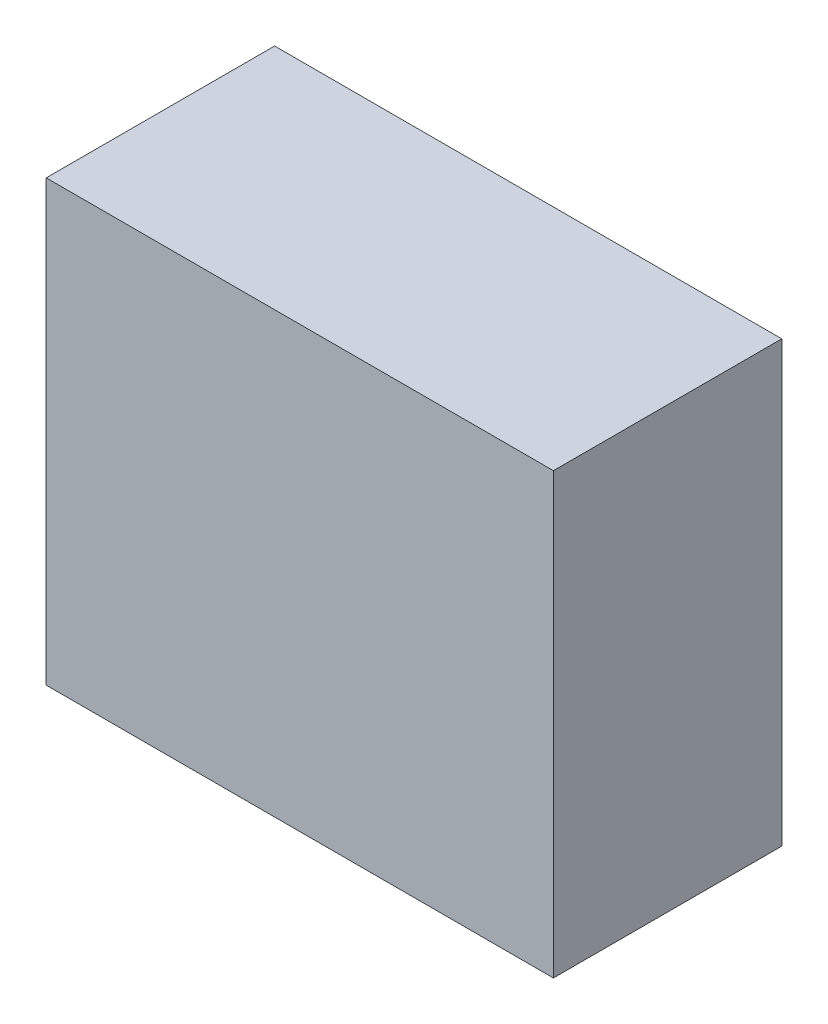
ISO-10303-21;
HEADER;
FILE_DESCRIPTION(('STEP AP214'),'2;1');
FILE_NAME('part.step','',(''),(''),'','','');
FILE_SCHEMA(('AUTOMOTIVE_DESIGN { 1 0 10303 214 1 1 1 1 }'));
ENDSEC;
DATA;
#1=APPLICATION_CONTEXT('core data for automotive mechanical design processes');
#2=APPLICATION_PROTOCOL_DEFINITION('international standard','automotive_design',2000,#1);
#3=PRODUCT_CONTEXT('',#1,'mechanical');
#4=PRODUCT('Part','Part','',(#3));
#5=PRODUCT_RELATED_PRODUCT_CATEGORY('part','',(#4));
#6=PRODUCT_DEFINITION_FORMATION('','',#4);
#7=PRODUCT_DEFINITION_CONTEXT('part definition',#1,'design');
#8=PRODUCT_DEFINITION('design','',#6,#7);
#9=PRODUCT_DEFINITION_SHAPE('','',#8);
#10=(LENGTH_UNIT() NAMED_UNIT(*) SI_UNIT(.MILLI.,.METRE.));
#11=(NAMED_UNIT(*) PLANE_ANGLE_UNIT() SI_UNIT($,.RADIAN.));
#12=(NAMED_UNIT(*) SI_UNIT($,.STERADIAN.) SOLID_ANGLE_UNIT());
#13=UNCERTAINTY_MEASURE_WITH_UNIT(LENGTH_MEASURE(1.E-05),#10,'distance_accuracy_value','');
#14=(GEOMETRIC_REPRESENTATION_CONTEXT(3) GLOBAL_UNCERTAINTY_ASSIGNED_CONTEXT((#13)) GLOBAL_UNIT_ASSIGNED_CONTEXT((#10,
#11,#12)) REPRESENTATION_CONTEXT('',''));
#15=CARTESIAN_POINT('',(0.,0.,0.));
#16=DIRECTION('',(0.,0.,1.));
#17=DIRECTION('',(1.,0.,0.));
#18=AXIS2_PLACEMENT_3D('',#15,#16,#17);
#19=CARTESIAN_POINT('',(22.225,38.5063999999999,10.0076));
#20=DIRECTION('',(-1.,0.,0.));
#21=DIRECTION('',(0.,0.,1.));
#22=AXIS2_PLACEMENT_3D('',#19,#20,#21);
#23=PLANE('',#22);
#24=DIRECTION('',(0.,0.,-1.));
#25=VECTOR('',#24,1.);
#26=CARTESIAN_POINT('',(22.225,0.,10.0076));
#27=LINE('',#26,#25);
#28=CARTESIAN_POINT('',(22.225,0.,10.0076));
#29=VERTEX_POINT('',#28);
#30=CARTESIAN_POINT('',(22.225,0.,-10.0076));
#31=VERTEX_POINT('',#30);
#32=EDGE_CURVE('E105',#29,#31,#27,.T.);
#33=ORIENTED_EDGE('',*,*,#32,.T.);
#34=DIRECTION('',(0.,-1.,0.));
#35=VECTOR('',#34,1.);
#36=CARTESIAN_POINT('',(22.225,38.5063999999999,-10.0076));
#37=LINE('',#36,#35);
#38=CARTESIAN_POINT('',(22.225,38.5063999999999,-10.0076));
#39=VERTEX_POINT('',#38);
#40=EDGE_CURVE('E11',#39,#31,#37,.T.);
#41=ORIENTED_EDGE('',*,*,#40,.F.);
#42=DIRECTION('',(0.,0.,-1.));
#43=VECTOR('',#42,1.);
#44=CARTESIAN_POINT('',(22.225,38.5063999999999,10.0076));
#45=LINE('',#44,#43);
#46=CARTESIAN_POINT('',(22.225,38.5063999999999,10.0076));
#47=VERTEX_POINT('',#46);
#48=EDGE_CURVE('E88',#47,#39,#45,.T.);
#49=ORIENTED_EDGE('',*,*,#48,.F.);
#50=DIRECTION('',(0.,-1.,0.));
#51=VECTOR('',#50,1.);
#52=CARTESIAN_POINT('',(22.225,38.5063999999999,10.0076));
#53=LINE('',#52,#51);
#54=EDGE_CURVE('E101',#47,#29,#53,.T.);
#55=ORIENTED_EDGE('',*,*,#54,.T.);
#56=EDGE_LOOP('',(#33,#41,#49,#55));
#57=FACE_BOUND('',#56,.T.);
#58=ADVANCED_FACE('F36',(#57),#23,.F.);
#59=CARTESIAN_POINT('',(-22.225,38.5063999999999,-10.0076));
#60=DIRECTION('',(0.,0.,1.));
#61=DIRECTION('',(1.,0.,0.));
#62=AXIS2_PLACEMENT_3D('',#59,#60,#61);
#63=PLANE('',#62);
#64=DIRECTION('',(-1.,0.,0.));
#65=VECTOR('',#64,1.);
#66=CARTESIAN_POINT('',(-22.225,0.,-10.0076));
#67=LINE('',#66,#65);
#68=CARTESIAN_POINT('',(-22.225,0.,-10.0076));
#69=VERTEX_POINT('',#68);
#70=EDGE_CURVE('E93',#31,#69,#67,.T.);
#71=ORIENTED_EDGE('',*,*,#70,.T.);
#72=DIRECTION('',(0.,-1.,0.));
#73=VECTOR('',#72,1.);
#74=CARTESIAN_POINT('',(-22.225,38.5063999999999,-10.0076));
#75=LINE('',#74,#73);
#76=CARTESIAN_POINT('',(-22.225,38.5063999999999,-10.0076));
#77=VERTEX_POINT('',#76);
#78=EDGE_CURVE('E45',#77,#69,#75,.T.);
#79=ORIENTED_EDGE('',*,*,#78,.F.);
#80=DIRECTION('',(-1.,0.,0.));
#81=VECTOR('',#80,1.);
#82=CARTESIAN_POINT('',(-22.225,38.5063999999999,-10.0076));
#83=LINE('',#82,#81);
#84=EDGE_CURVE('E83',#39,#77,#83,.T.);
#85=ORIENTED_EDGE('',*,*,#84,.F.);
#86=ORIENTED_EDGE('',*,*,#40,.T.);
#87=EDGE_LOOP('',(#71,#79,#85,#86));
#88=FACE_BOUND('',#87,.T.);
#89=ADVANCED_FACE('F92',(#88),#63,.F.);
#90=CARTESIAN_POINT('',(-22.225,38.5063999999999,10.0076));
#91=DIRECTION('',(1.,0.,0.));
#92=DIRECTION('',(0.,0.,-1.));
#93=AXIS2_PLACEMENT_3D('',#90,#91,#92);
#94=PLANE('',#93);
#95=DIRECTION('',(0.,0.,1.));
#96=VECTOR('',#95,1.);
#97=CARTESIAN_POINT('',(-22.225,0.,10.0076));
#98=LINE('',#97,#96);
#99=CARTESIAN_POINT('',(-22.225,0.,10.0076));
#100=VERTEX_POINT('',#99);
#101=EDGE_CURVE('E70',#69,#100,#98,.T.);
#102=ORIENTED_EDGE('',*,*,#101,.T.);
#103=DIRECTION('',(0.,-1.,0.));
#104=VECTOR('',#103,1.);
#105=CARTESIAN_POINT('',(-22.225,38.5063999999999,10.0076));
#106=LINE('',#105,#104);
#107=CARTESIAN_POINT('',(-22.225,38.5063999999999,10.0076));
#108=VERTEX_POINT('',#107);
#109=EDGE_CURVE('E95',#108,#100,#106,.T.);
#110=ORIENTED_EDGE('',*,*,#109,.F.);
#111=DIRECTION('',(0.,0.,1.));
#112=VECTOR('',#111,1.);
#113=CARTESIAN_POINT('',(-22.225,38.5063999999999,10.0076));
#114=LINE('',#113,#112);
#115=EDGE_CURVE('E86',#77,#108,#114,.T.);
#116=ORIENTED_EDGE('',*,*,#115,.F.);
#117=ORIENTED_EDGE('',*,*,#78,.T.);
#118=EDGE_LOOP('',(#102,#110,#116,#117));
#119=FACE_BOUND('',#118,.T.);
#120=ADVANCED_FACE('F96',(#119),#94,.F.);
#121=CARTESIAN_POINT('',(-22.225,38.5063999999999,10.0076));
#122=DIRECTION('',(0.,0.,-1.));
#123=DIRECTION('',(-1.,0.,0.));
#124=AXIS2_PLACEMENT_3D('',#121,#122,#123);
#125=PLANE('',#124);
#126=DIRECTION('',(1.,0.,0.));
#127=VECTOR('',#126,1.);
#128=CARTESIAN_POINT('',(-22.225,0.,10.0076));
#129=LINE('',#128,#127);
#130=EDGE_CURVE('E76',#100,#29,#129,.T.);
#131=ORIENTED_EDGE('',*,*,#130,.T.);
#132=ORIENTED_EDGE('',*,*,#54,.F.);
#133=DIRECTION('',(1.,0.,0.));
#134=VECTOR('',#133,1.);
#135=CARTESIAN_POINT('',(-22.225,38.5063999999999,10.0076));
#136=LINE('',#135,#134);
#137=EDGE_CURVE('E53',#108,#47,#136,.T.);
#138=ORIENTED_EDGE('',*,*,#137,.F.);
#139=ORIENTED_EDGE('',*,*,#109,.T.);
#140=EDGE_LOOP('',(#131,#132,#138,#139));
#141=FACE_BOUND('',#140,.T.);
#142=ADVANCED_FACE('F119',(#141),#125,.F.);
#143=CARTESIAN_POINT('',(0.,38.5063999999999,0.));
#144=DIRECTION('',(0.,-1.,0.));
#145=DIRECTION('',(0.,0.,-1.));
#146=AXIS2_PLACEMENT_3D('',#143,#144,#145);
#147=PLANE('',#146);
#148=ORIENTED_EDGE('',*,*,#48,.T.);
#149=ORIENTED_EDGE('',*,*,#84,.T.);
#150=ORIENTED_EDGE('',*,*,#115,.T.);
#151=ORIENTED_EDGE('',*,*,#137,.T.);
#152=EDGE_LOOP('',(#148,#149,#150,#151));
#153=FACE_BOUND('',#152,.T.);
#154=ADVANCED_FACE('F84',(#153),#147,.F.);
#155=CARTESIAN_POINT('',(0.,0.,0.));
#156=DIRECTION('',(0.,-1.,0.));
#157=DIRECTION('',(0.,0.,-1.));
#158=AXIS2_PLACEMENT_3D('',#155,#156,#157);
#159=PLANE('',#158);
#160=ORIENTED_EDGE('',*,*,#32,.F.);
#161=ORIENTED_EDGE('',*,*,#130,.F.);
#162=ORIENTED_EDGE('',*,*,#101,.F.);
#163=ORIENTED_EDGE('',*,*,#70,.F.);
#164=EDGE_LOOP('',(#160,#161,#162,#163));
#165=FACE_BOUND('',#164,.T.);
#166=ADVANCED_FACE('F122',(#165),#159,.T.);
#167=CLOSED_SHELL('',(#58,#89,#120,#142,#154,#166));
#168=MANIFOLD_SOLID_BREP('B2',#167);
#169=ADVANCED_BREP_SHAPE_REPRESENTATION('',(#18,#168),#14);
#170=SHAPE_DEFINITION_REPRESENTATION(#9,#169);
ENDSEC;
END-ISO-10303-21;
